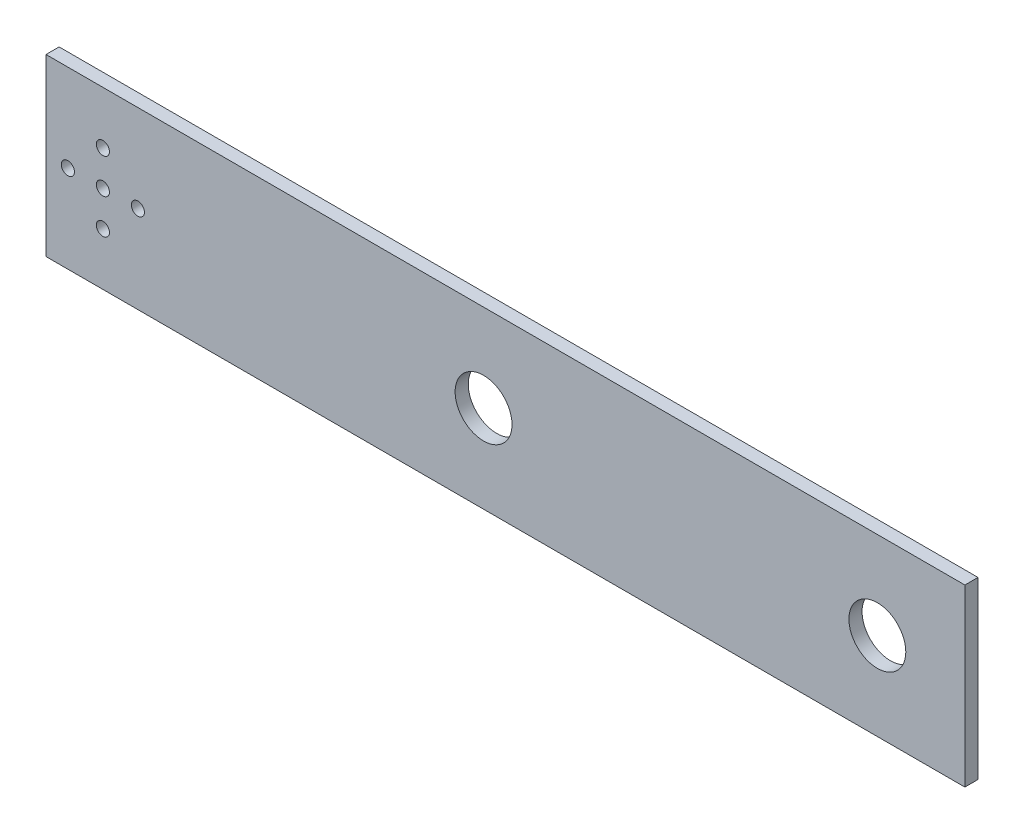
ISO-10303-21;
HEADER;
FILE_DESCRIPTION(('STEP AP214'),'2;1');
FILE_NAME('part.step','',(''),(''),'','','');
FILE_SCHEMA(('AUTOMOTIVE_DESIGN { 1 0 10303 214 1 1 1 1 }'));
ENDSEC;
DATA;
#1=APPLICATION_CONTEXT('core data for automotive mechanical design processes');
#2=APPLICATION_PROTOCOL_DEFINITION('international standard','automotive_design',2000,#1);
#3=PRODUCT_CONTEXT('',#1,'mechanical');
#4=PRODUCT('Part','Part','',(#3));
#5=PRODUCT_RELATED_PRODUCT_CATEGORY('part','',(#4));
#6=PRODUCT_DEFINITION_FORMATION('','',#4);
#7=PRODUCT_DEFINITION_CONTEXT('part definition',#1,'design');
#8=PRODUCT_DEFINITION('design','',#6,#7);
#9=PRODUCT_DEFINITION_SHAPE('','',#8);
#10=(LENGTH_UNIT() NAMED_UNIT(*) SI_UNIT(.MILLI.,.METRE.));
#11=(NAMED_UNIT(*) PLANE_ANGLE_UNIT() SI_UNIT($,.RADIAN.));
#12=(NAMED_UNIT(*) SI_UNIT($,.STERADIAN.) SOLID_ANGLE_UNIT());
#13=UNCERTAINTY_MEASURE_WITH_UNIT(LENGTH_MEASURE(1.E-05),#10,'distance_accuracy_value','');
#14=(GEOMETRIC_REPRESENTATION_CONTEXT(3) GLOBAL_UNCERTAINTY_ASSIGNED_CONTEXT((#13)) GLOBAL_UNIT_ASSIGNED_CONTEXT((#10,
#11,#12)) REPRESENTATION_CONTEXT('',''));
#15=CARTESIAN_POINT('',(0.,0.,0.));
#16=DIRECTION('',(0.,0.,1.));
#17=DIRECTION('',(1.,0.,0.));
#18=AXIS2_PLACEMENT_3D('',#15,#16,#17);
#19=CARTESIAN_POINT('',(-9.99999999999998,20.,3.));
#20=DIRECTION('',(1.,0.,0.));
#21=DIRECTION('',(0.,0.,-1.));
#22=AXIS2_PLACEMENT_3D('',#19,#20,#21);
#23=PLANE('',#22);
#24=DIRECTION('',(0.,-1.,0.));
#25=VECTOR('',#24,1.);
#26=CARTESIAN_POINT('',(-9.99999999999998,20.,0.));
#27=LINE('',#26,#25);
#28=CARTESIAN_POINT('',(-9.99999999999998,20.,0.));
#29=VERTEX_POINT('',#28);
#30=CARTESIAN_POINT('',(-9.99999999999998,-20.,0.));
#31=VERTEX_POINT('',#30);
#32=EDGE_CURVE('E100',#29,#31,#27,.T.);
#33=ORIENTED_EDGE('',*,*,#32,.T.);
#34=DIRECTION('',(0.,0.,-1.));
#35=VECTOR('',#34,1.);
#36=CARTESIAN_POINT('',(-9.99999999999998,-20.,3.));
#37=LINE('',#36,#35);
#38=CARTESIAN_POINT('',(-9.99999999999998,-20.,3.));
#39=VERTEX_POINT('',#38);
#40=EDGE_CURVE('E11',#39,#31,#37,.T.);
#41=ORIENTED_EDGE('',*,*,#40,.F.);
#42=DIRECTION('',(0.,-1.,0.));
#43=VECTOR('',#42,1.);
#44=CARTESIAN_POINT('',(-9.99999999999998,20.,3.));
#45=LINE('',#44,#43);
#46=CARTESIAN_POINT('',(-9.99999999999998,20.,3.));
#47=VERTEX_POINT('',#46);
#48=EDGE_CURVE('E86',#47,#39,#45,.T.);
#49=ORIENTED_EDGE('',*,*,#48,.F.);
#50=DIRECTION('',(0.,0.,-1.));
#51=VECTOR('',#50,1.);
#52=CARTESIAN_POINT('',(-9.99999999999998,20.,3.));
#53=LINE('',#52,#51);
#54=EDGE_CURVE('E53',#47,#29,#53,.T.);
#55=ORIENTED_EDGE('',*,*,#54,.T.);
#56=EDGE_LOOP('',(#33,#41,#49,#55));
#57=FACE_BOUND('',#56,.T.);
#58=ADVANCED_FACE('F37',(#57),#23,.F.);
#59=CARTESIAN_POINT('',(-9.99999999999998,-20.,3.));
#60=DIRECTION('',(0.,1.,0.));
#61=DIRECTION('',(0.,0.,1.));
#62=AXIS2_PLACEMENT_3D('',#59,#60,#61);
#63=PLANE('',#62);
#64=DIRECTION('',(1.,0.,0.));
#65=VECTOR('',#64,1.);
#66=CARTESIAN_POINT('',(-9.99999999999998,-20.,0.));
#67=LINE('',#66,#65);
#68=CARTESIAN_POINT('',(200.,-20.,0.));
#69=VERTEX_POINT('',#68);
#70=EDGE_CURVE('E91',#31,#69,#67,.T.);
#71=ORIENTED_EDGE('',*,*,#70,.T.);
#72=DIRECTION('',(0.,0.,-1.));
#73=VECTOR('',#72,1.);
#74=CARTESIAN_POINT('',(200.,-20.,3.));
#75=LINE('',#74,#73);
#76=CARTESIAN_POINT('',(200.,-20.,3.));
#77=VERTEX_POINT('',#76);
#78=EDGE_CURVE('E45',#77,#69,#75,.T.);
#79=ORIENTED_EDGE('',*,*,#78,.F.);
#80=DIRECTION('',(1.,0.,0.));
#81=VECTOR('',#80,1.);
#82=CARTESIAN_POINT('',(-9.99999999999998,-20.,3.));
#83=LINE('',#82,#81);
#84=EDGE_CURVE('E79',#39,#77,#83,.T.);
#85=ORIENTED_EDGE('',*,*,#84,.F.);
#86=ORIENTED_EDGE('',*,*,#40,.T.);
#87=EDGE_LOOP('',(#71,#79,#85,#86));
#88=FACE_BOUND('',#87,.T.);
#89=ADVANCED_FACE('F90',(#88),#63,.F.);
#90=CARTESIAN_POINT('',(200.,-20.,3.));
#91=DIRECTION('',(-1.,0.,0.));
#92=DIRECTION('',(0.,0.,1.));
#93=AXIS2_PLACEMENT_3D('',#90,#91,#92);
#94=PLANE('',#93);
#95=DIRECTION('',(0.,1.,0.));
#96=VECTOR('',#95,1.);
#97=CARTESIAN_POINT('',(200.,-20.,0.));
#98=LINE('',#97,#96);
#99=CARTESIAN_POINT('',(200.,20.,0.));
#100=VERTEX_POINT('',#99);
#101=EDGE_CURVE('E104',#69,#100,#98,.T.);
#102=ORIENTED_EDGE('',*,*,#101,.T.);
#103=DIRECTION('',(0.,0.,-1.));
#104=VECTOR('',#103,1.);
#105=CARTESIAN_POINT('',(200.,20.,3.));
#106=LINE('',#105,#104);
#107=CARTESIAN_POINT('',(200.,20.,3.));
#108=VERTEX_POINT('',#107);
#109=EDGE_CURVE('E68',#108,#100,#106,.T.);
#110=ORIENTED_EDGE('',*,*,#109,.F.);
#111=DIRECTION('',(0.,1.,0.));
#112=VECTOR('',#111,1.);
#113=CARTESIAN_POINT('',(200.,-20.,3.));
#114=LINE('',#113,#112);
#115=EDGE_CURVE('E85',#77,#108,#114,.T.);
#116=ORIENTED_EDGE('',*,*,#115,.F.);
#117=ORIENTED_EDGE('',*,*,#78,.T.);
#118=EDGE_LOOP('',(#102,#110,#116,#117));
#119=FACE_BOUND('',#118,.T.);
#120=ADVANCED_FACE('F94',(#119),#94,.F.);
#121=CARTESIAN_POINT('',(-9.99999999999998,20.,3.));
#122=DIRECTION('',(0.,1.,0.));
#123=DIRECTION('',(0.,0.,1.));
#124=AXIS2_PLACEMENT_3D('',#121,#122,#123);
#125=PLANE('',#124);
#126=DIRECTION('',(1.,0.,0.));
#127=VECTOR('',#126,1.);
#128=CARTESIAN_POINT('',(-9.99999999999998,20.,0.));
#129=LINE('',#128,#127);
#130=EDGE_CURVE('E106',#29,#100,#129,.T.);
#131=ORIENTED_EDGE('',*,*,#130,.F.);
#132=ORIENTED_EDGE('',*,*,#54,.F.);
#133=DIRECTION('',(1.,0.,0.));
#134=VECTOR('',#133,1.);
#135=CARTESIAN_POINT('',(-9.99999999999998,20.,3.));
#136=LINE('',#135,#134);
#137=EDGE_CURVE('E95',#47,#108,#136,.T.);
#138=ORIENTED_EDGE('',*,*,#137,.T.);
#139=ORIENTED_EDGE('',*,*,#109,.T.);
#140=EDGE_LOOP('',(#131,#132,#138,#139));
#141=FACE_BOUND('',#140,.T.);
#142=ADVANCED_FACE('F159',(#141),#125,.T.);
#143=CARTESIAN_POINT('',(0.,0.,3.));
#144=DIRECTION('',(0.,0.,1.));
#145=DIRECTION('',(1.,0.,0.));
#146=AXIS2_PLACEMENT_3D('',#143,#144,#145);
#147=PLANE('',#146);
#148=CARTESIAN_POINT('',(90.,0.,3.));
#149=DIRECTION('',(0.,0.,1.));
#150=DIRECTION('',(1.,0.,0.));
#151=AXIS2_PLACEMENT_3D('',#148,#149,#150);
#152=CIRCLE('',#151,6.50000000000001);
#153=CARTESIAN_POINT('',(96.5,0.,3.));
#154=VERTEX_POINT('',#153);
#155=EDGE_CURVE('E150',#154,#154,#152,.T.);
#156=ORIENTED_EDGE('',*,*,#155,.F.);
#157=EDGE_LOOP('',(#156));
#158=FACE_BOUND('',#157,.T.);
#159=CARTESIAN_POINT('',(180.,0.,3.));
#160=DIRECTION('',(0.,0.,1.));
#161=DIRECTION('',(1.,0.,0.));
#162=AXIS2_PLACEMENT_3D('',#159,#160,#161);
#163=CIRCLE('',#162,6.50000000000001);
#164=CARTESIAN_POINT('',(186.5,0.,3.));
#165=VERTEX_POINT('',#164);
#166=EDGE_CURVE('E144',#165,#165,#163,.T.);
#167=ORIENTED_EDGE('',*,*,#166,.F.);
#168=EDGE_LOOP('',(#167));
#169=FACE_BOUND('',#168,.T.);
#170=CARTESIAN_POINT('',(3.00000000000002,8.,3.));
#171=DIRECTION('',(0.,0.,-1.));
#172=DIRECTION('',(-1.,0.,0.));
#173=AXIS2_PLACEMENT_3D('',#170,#171,#172);
#174=CIRCLE('',#173,1.5);
#175=CARTESIAN_POINT('',(1.50000000000002,8.,3.));
#176=VERTEX_POINT('',#175);
#177=EDGE_CURVE('E135',#176,#176,#174,.T.);
#178=ORIENTED_EDGE('',*,*,#177,.T.);
#179=EDGE_LOOP('',(#178));
#180=FACE_BOUND('',#179,.T.);
#181=CARTESIAN_POINT('',(11.,0.,3.));
#182=DIRECTION('',(0.,0.,-1.));
#183=DIRECTION('',(-1.,0.,0.));
#184=AXIS2_PLACEMENT_3D('',#181,#182,#183);
#185=CIRCLE('',#184,1.5);
#186=CARTESIAN_POINT('',(9.50000000000002,0.,3.));
#187=VERTEX_POINT('',#186);
#188=EDGE_CURVE('E129',#187,#187,#185,.T.);
#189=ORIENTED_EDGE('',*,*,#188,.T.);
#190=EDGE_LOOP('',(#189));
#191=FACE_BOUND('',#190,.T.);
#192=CARTESIAN_POINT('',(-4.99999999999998,0.,3.));
#193=DIRECTION('',(0.,0.,-1.));
#194=DIRECTION('',(-1.,0.,0.));
#195=AXIS2_PLACEMENT_3D('',#192,#193,#194);
#196=CIRCLE('',#195,1.5);
#197=CARTESIAN_POINT('',(-6.49999999999998,0.,3.));
#198=VERTEX_POINT('',#197);
#199=EDGE_CURVE('E123',#198,#198,#196,.T.);
#200=ORIENTED_EDGE('',*,*,#199,.T.);
#201=EDGE_LOOP('',(#200));
#202=FACE_BOUND('',#201,.T.);
#203=CARTESIAN_POINT('',(3.00000000000002,-8.,3.));
#204=DIRECTION('',(0.,0.,-1.));
#205=DIRECTION('',(-1.,0.,0.));
#206=AXIS2_PLACEMENT_3D('',#203,#204,#205);
#207=CIRCLE('',#206,1.5);
#208=CARTESIAN_POINT('',(1.50000000000002,-8.,3.));
#209=VERTEX_POINT('',#208);
#210=EDGE_CURVE('E117',#209,#209,#207,.T.);
#211=ORIENTED_EDGE('',*,*,#210,.T.);
#212=EDGE_LOOP('',(#211));
#213=FACE_BOUND('',#212,.T.);
#214=CARTESIAN_POINT('',(3.00000000000002,0.,3.));
#215=DIRECTION('',(0.,0.,-1.));
#216=DIRECTION('',(-1.,0.,0.));
#217=AXIS2_PLACEMENT_3D('',#214,#215,#216);
#218=CIRCLE('',#217,1.5);
#219=CARTESIAN_POINT('',(1.50000000000002,0.,3.));
#220=VERTEX_POINT('',#219);
#221=EDGE_CURVE('E102',#220,#220,#218,.T.);
#222=ORIENTED_EDGE('',*,*,#221,.T.);
#223=EDGE_LOOP('',(#222));
#224=FACE_BOUND('',#223,.T.);
#225=ORIENTED_EDGE('',*,*,#48,.T.);
#226=ORIENTED_EDGE('',*,*,#84,.T.);
#227=ORIENTED_EDGE('',*,*,#115,.T.);
#228=ORIENTED_EDGE('',*,*,#137,.F.);
#229=EDGE_LOOP('',(#225,#226,#227,#228));
#230=FACE_BOUND('',#229,.T.);
#231=ADVANCED_FACE('F82',(#158,#169,#180,#191,#202,#213,#224,#230),#147,.T.);
#232=CARTESIAN_POINT('',(0.,0.,0.));
#233=DIRECTION('',(0.,0.,1.));
#234=DIRECTION('',(1.,0.,0.));
#235=AXIS2_PLACEMENT_3D('',#232,#233,#234);
#236=PLANE('',#235);
#237=CARTESIAN_POINT('',(90.,0.,0.));
#238=DIRECTION('',(0.,0.,1.));
#239=DIRECTION('',(1.,0.,0.));
#240=AXIS2_PLACEMENT_3D('',#237,#238,#239);
#241=CIRCLE('',#240,6.50000000000001);
#242=CARTESIAN_POINT('',(96.5,0.,0.));
#243=VERTEX_POINT('',#242);
#244=EDGE_CURVE('E147',#243,#243,#241,.T.);
#245=ORIENTED_EDGE('',*,*,#244,.T.);
#246=EDGE_LOOP('',(#245));
#247=FACE_BOUND('',#246,.T.);
#248=CARTESIAN_POINT('',(180.,0.,0.));
#249=DIRECTION('',(0.,0.,1.));
#250=DIRECTION('',(1.,0.,0.));
#251=AXIS2_PLACEMENT_3D('',#248,#249,#250);
#252=CIRCLE('',#251,6.50000000000001);
#253=CARTESIAN_POINT('',(186.5,0.,0.));
#254=VERTEX_POINT('',#253);
#255=EDGE_CURVE('E141',#254,#254,#252,.T.);
#256=ORIENTED_EDGE('',*,*,#255,.T.);
#257=EDGE_LOOP('',(#256));
#258=FACE_BOUND('',#257,.T.);
#259=CARTESIAN_POINT('',(3.00000000000002,8.,0.));
#260=DIRECTION('',(0.,0.,-1.));
#261=DIRECTION('',(-1.,0.,0.));
#262=AXIS2_PLACEMENT_3D('',#259,#260,#261);
#263=CIRCLE('',#262,1.5);
#264=CARTESIAN_POINT('',(1.50000000000002,8.,0.));
#265=VERTEX_POINT('',#264);
#266=EDGE_CURVE('E138',#265,#265,#263,.T.);
#267=ORIENTED_EDGE('',*,*,#266,.F.);
#268=EDGE_LOOP('',(#267));
#269=FACE_BOUND('',#268,.T.);
#270=CARTESIAN_POINT('',(11.,0.,0.));
#271=DIRECTION('',(0.,0.,-1.));
#272=DIRECTION('',(-1.,0.,0.));
#273=AXIS2_PLACEMENT_3D('',#270,#271,#272);
#274=CIRCLE('',#273,1.5);
#275=CARTESIAN_POINT('',(9.50000000000002,0.,0.));
#276=VERTEX_POINT('',#275);
#277=EDGE_CURVE('E132',#276,#276,#274,.T.);
#278=ORIENTED_EDGE('',*,*,#277,.F.);
#279=EDGE_LOOP('',(#278));
#280=FACE_BOUND('',#279,.T.);
#281=CARTESIAN_POINT('',(-4.99999999999998,0.,0.));
#282=DIRECTION('',(0.,0.,-1.));
#283=DIRECTION('',(-1.,0.,0.));
#284=AXIS2_PLACEMENT_3D('',#281,#282,#283);
#285=CIRCLE('',#284,1.5);
#286=CARTESIAN_POINT('',(-6.49999999999998,0.,0.));
#287=VERTEX_POINT('',#286);
#288=EDGE_CURVE('E126',#287,#287,#285,.T.);
#289=ORIENTED_EDGE('',*,*,#288,.F.);
#290=EDGE_LOOP('',(#289));
#291=FACE_BOUND('',#290,.T.);
#292=CARTESIAN_POINT('',(3.00000000000002,-8.,0.));
#293=DIRECTION('',(0.,0.,-1.));
#294=DIRECTION('',(-1.,0.,0.));
#295=AXIS2_PLACEMENT_3D('',#292,#293,#294);
#296=CIRCLE('',#295,1.5);
#297=CARTESIAN_POINT('',(1.50000000000002,-8.,0.));
#298=VERTEX_POINT('',#297);
#299=EDGE_CURVE('E120',#298,#298,#296,.T.);
#300=ORIENTED_EDGE('',*,*,#299,.F.);
#301=EDGE_LOOP('',(#300));
#302=FACE_BOUND('',#301,.T.);
#303=CARTESIAN_POINT('',(3.00000000000002,0.,0.));
#304=DIRECTION('',(0.,0.,-1.));
#305=DIRECTION('',(-1.,0.,0.));
#306=AXIS2_PLACEMENT_3D('',#303,#304,#305);
#307=CIRCLE('',#306,1.5);
#308=CARTESIAN_POINT('',(1.50000000000002,0.,0.));
#309=VERTEX_POINT('',#308);
#310=EDGE_CURVE('E114',#309,#309,#307,.T.);
#311=ORIENTED_EDGE('',*,*,#310,.F.);
#312=EDGE_LOOP('',(#311));
#313=FACE_BOUND('',#312,.T.);
#314=ORIENTED_EDGE('',*,*,#32,.F.);
#315=ORIENTED_EDGE('',*,*,#130,.T.);
#316=ORIENTED_EDGE('',*,*,#101,.F.);
#317=ORIENTED_EDGE('',*,*,#70,.F.);
#318=EDGE_LOOP('',(#314,#315,#316,#317));
#319=FACE_BOUND('',#318,.T.);
#320=ADVANCED_FACE('F158',(#247,#258,#269,#280,#291,#302,#313,#319),#236,.F.);
#321=CARTESIAN_POINT('',(3.00000000000002,0.,0.));
#322=DIRECTION('',(0.,0.,-1.));
#323=DIRECTION('',(-1.,0.,0.));
#324=AXIS2_PLACEMENT_3D('',#321,#322,#323);
#325=CYLINDRICAL_SURFACE('',#324,1.5);
#326=ORIENTED_EDGE('',*,*,#221,.F.);
#327=EDGE_LOOP('',(#326));
#328=FACE_BOUND('',#327,.T.);
#329=ORIENTED_EDGE('',*,*,#310,.T.);
#330=EDGE_LOOP('',(#329));
#331=FACE_BOUND('',#330,.T.);
#332=ADVANCED_FACE('F173',(#328,#331),#325,.F.);
#333=CARTESIAN_POINT('',(3.00000000000002,-8.,0.));
#334=DIRECTION('',(0.,0.,-1.));
#335=DIRECTION('',(-1.,0.,0.));
#336=AXIS2_PLACEMENT_3D('',#333,#334,#335);
#337=CYLINDRICAL_SURFACE('',#336,1.5);
#338=ORIENTED_EDGE('',*,*,#210,.F.);
#339=EDGE_LOOP('',(#338));
#340=FACE_BOUND('',#339,.T.);
#341=ORIENTED_EDGE('',*,*,#299,.T.);
#342=EDGE_LOOP('',(#341));
#343=FACE_BOUND('',#342,.T.);
#344=ADVANCED_FACE('F176',(#340,#343),#337,.F.);
#345=CARTESIAN_POINT('',(-4.99999999999998,0.,0.));
#346=DIRECTION('',(0.,0.,-1.));
#347=DIRECTION('',(-1.,0.,0.));
#348=AXIS2_PLACEMENT_3D('',#345,#346,#347);
#349=CYLINDRICAL_SURFACE('',#348,1.5);
#350=ORIENTED_EDGE('',*,*,#199,.F.);
#351=EDGE_LOOP('',(#350));
#352=FACE_BOUND('',#351,.T.);
#353=ORIENTED_EDGE('',*,*,#288,.T.);
#354=EDGE_LOOP('',(#353));
#355=FACE_BOUND('',#354,.T.);
#356=ADVANCED_FACE('F220',(#352,#355),#349,.F.);
#357=CARTESIAN_POINT('',(11.,0.,0.));
#358=DIRECTION('',(0.,0.,-1.));
#359=DIRECTION('',(-1.,0.,0.));
#360=AXIS2_PLACEMENT_3D('',#357,#358,#359);
#361=CYLINDRICAL_SURFACE('',#360,1.5);
#362=ORIENTED_EDGE('',*,*,#188,.F.);
#363=EDGE_LOOP('',(#362));
#364=FACE_BOUND('',#363,.T.);
#365=ORIENTED_EDGE('',*,*,#277,.T.);
#366=EDGE_LOOP('',(#365));
#367=FACE_BOUND('',#366,.T.);
#368=ADVANCED_FACE('F230',(#364,#367),#361,.F.);
#369=CARTESIAN_POINT('',(3.00000000000002,8.,0.));
#370=DIRECTION('',(0.,0.,-1.));
#371=DIRECTION('',(-1.,0.,0.));
#372=AXIS2_PLACEMENT_3D('',#369,#370,#371);
#373=CYLINDRICAL_SURFACE('',#372,1.5);
#374=ORIENTED_EDGE('',*,*,#177,.F.);
#375=EDGE_LOOP('',(#374));
#376=FACE_BOUND('',#375,.T.);
#377=ORIENTED_EDGE('',*,*,#266,.T.);
#378=EDGE_LOOP('',(#377));
#379=FACE_BOUND('',#378,.T.);
#380=ADVANCED_FACE('F240',(#376,#379),#373,.F.);
#381=CARTESIAN_POINT('',(180.,0.,3.));
#382=DIRECTION('',(0.,0.,1.));
#383=DIRECTION('',(1.,0.,0.));
#384=AXIS2_PLACEMENT_3D('',#381,#382,#383);
#385=CYLINDRICAL_SURFACE('',#384,6.50000000000001);
#386=ORIENTED_EDGE('',*,*,#255,.F.);
#387=EDGE_LOOP('',(#386));
#388=FACE_BOUND('',#387,.T.);
#389=ORIENTED_EDGE('',*,*,#166,.T.);
#390=EDGE_LOOP('',(#389));
#391=FACE_BOUND('',#390,.T.);
#392=ADVANCED_FACE('F250',(#388,#391),#385,.F.);
#393=CARTESIAN_POINT('',(90.,0.,3.));
#394=DIRECTION('',(0.,0.,1.));
#395=DIRECTION('',(1.,0.,0.));
#396=AXIS2_PLACEMENT_3D('',#393,#394,#395);
#397=CYLINDRICAL_SURFACE('',#396,6.50000000000001);
#398=ORIENTED_EDGE('',*,*,#244,.F.);
#399=EDGE_LOOP('',(#398));
#400=FACE_BOUND('',#399,.T.);
#401=ORIENTED_EDGE('',*,*,#155,.T.);
#402=EDGE_LOOP('',(#401));
#403=FACE_BOUND('',#402,.T.);
#404=ADVANCED_FACE('F154',(#400,#403),#397,.F.);
#405=CLOSED_SHELL('',(#58,#89,#120,#142,#231,#320,#332,#344,#356,#368,#380,#392,#404));
#406=MANIFOLD_SOLID_BREP('B2',#405);
#407=ADVANCED_BREP_SHAPE_REPRESENTATION('',(#18,#406),#14);
#408=SHAPE_DEFINITION_REPRESENTATION(#9,#407);
ENDSEC;
END-ISO-10303-21;
